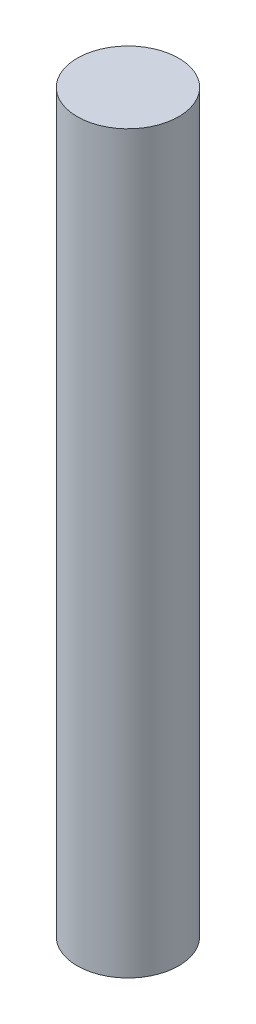
ISO-10303-21;
HEADER;
FILE_DESCRIPTION(('STEP AP214'),'2;1');
FILE_NAME('part.step','',(''),(''),'','','');
FILE_SCHEMA(('AUTOMOTIVE_DESIGN { 1 0 10303 214 1 1 1 1 }'));
ENDSEC;
DATA;
#1=APPLICATION_CONTEXT('core data for automotive mechanical design processes');
#2=APPLICATION_PROTOCOL_DEFINITION('international standard','automotive_design',2000,#1);
#3=PRODUCT_CONTEXT('',#1,'mechanical');
#4=PRODUCT('Part','Part','',(#3));
#5=PRODUCT_RELATED_PRODUCT_CATEGORY('part','',(#4));
#6=PRODUCT_DEFINITION_FORMATION('','',#4);
#7=PRODUCT_DEFINITION_CONTEXT('part definition',#1,'design');
#8=PRODUCT_DEFINITION('design','',#6,#7);
#9=PRODUCT_DEFINITION_SHAPE('','',#8);
#10=(LENGTH_UNIT() NAMED_UNIT(*) SI_UNIT(.MILLI.,.METRE.));
#11=(NAMED_UNIT(*) PLANE_ANGLE_UNIT() SI_UNIT($,.RADIAN.));
#12=(NAMED_UNIT(*) SI_UNIT($,.STERADIAN.) SOLID_ANGLE_UNIT());
#13=UNCERTAINTY_MEASURE_WITH_UNIT(LENGTH_MEASURE(1.E-05),#10,'distance_accuracy_value','');
#14=(GEOMETRIC_REPRESENTATION_CONTEXT(3) GLOBAL_UNCERTAINTY_ASSIGNED_CONTEXT((#13)) GLOBAL_UNIT_ASSIGNED_CONTEXT((#10,
#11,#12)) REPRESENTATION_CONTEXT('',''));
#15=CARTESIAN_POINT('',(0.,0.,0.));
#16=DIRECTION('',(0.,0.,1.));
#17=DIRECTION('',(1.,0.,0.));
#18=AXIS2_PLACEMENT_3D('',#15,#16,#17);
#19=CARTESIAN_POINT('',(0.,14.5,0.));
#20=DIRECTION('',(0.,-1.,0.));
#21=DIRECTION('',(0.,0.,-1.));
#22=AXIS2_PLACEMENT_3D('',#19,#20,#21);
#23=CYLINDRICAL_SURFACE('',#22,1.);
#24=CARTESIAN_POINT('',(0.,14.5,0.));
#25=DIRECTION('',(0.,1.,0.));
#26=DIRECTION('',(0.,0.,1.));
#27=AXIS2_PLACEMENT_3D('',#24,#25,#26);
#28=CIRCLE('',#27,1.);
#29=CARTESIAN_POINT('',(0.,14.5,1.));
#30=VERTEX_POINT('',#29);
#31=EDGE_CURVE('E10',#30,#30,#28,.T.);
#32=ORIENTED_EDGE('',*,*,#31,.F.);
#33=EDGE_LOOP('',(#32));
#34=FACE_BOUND('',#33,.T.);
#35=CARTESIAN_POINT('',(0.,0.,0.));
#36=DIRECTION('',(0.,1.,0.));
#37=DIRECTION('',(0.,0.,1.));
#38=AXIS2_PLACEMENT_3D('',#35,#36,#37);
#39=CIRCLE('',#38,1.);
#40=CARTESIAN_POINT('',(0.,0.,1.));
#41=VERTEX_POINT('',#40);
#42=EDGE_CURVE('E44',#41,#41,#39,.T.);
#43=ORIENTED_EDGE('',*,*,#42,.T.);
#44=EDGE_LOOP('',(#43));
#45=FACE_BOUND('',#44,.T.);
#46=ADVANCED_FACE('F41',(#34,#45),#23,.T.);
#47=CARTESIAN_POINT('',(0.,14.5,0.));
#48=DIRECTION('',(0.,1.,0.));
#49=DIRECTION('',(0.,0.,1.));
#50=AXIS2_PLACEMENT_3D('',#47,#48,#49);
#51=PLANE('',#50);
#52=ORIENTED_EDGE('',*,*,#31,.T.);
#53=EDGE_LOOP('',(#52));
#54=FACE_BOUND('',#53,.T.);
#55=ADVANCED_FACE('F58',(#54),#51,.T.);
#56=CARTESIAN_POINT('',(0.,0.,0.));
#57=DIRECTION('',(0.,1.,0.));
#58=DIRECTION('',(0.,0.,1.));
#59=AXIS2_PLACEMENT_3D('',#56,#57,#58);
#60=PLANE('',#59);
#61=ORIENTED_EDGE('',*,*,#42,.F.);
#62=EDGE_LOOP('',(#61));
#63=FACE_BOUND('',#62,.T.);
#64=ADVANCED_FACE('F56',(#63),#60,.F.);
#65=CLOSED_SHELL('',(#46,#55,#64));
#66=MANIFOLD_SOLID_BREP('B2',#65);
#67=ADVANCED_BREP_SHAPE_REPRESENTATION('',(#18,#66),#14);
#68=SHAPE_DEFINITION_REPRESENTATION(#9,#67);
ENDSEC;
END-ISO-10303-21;
